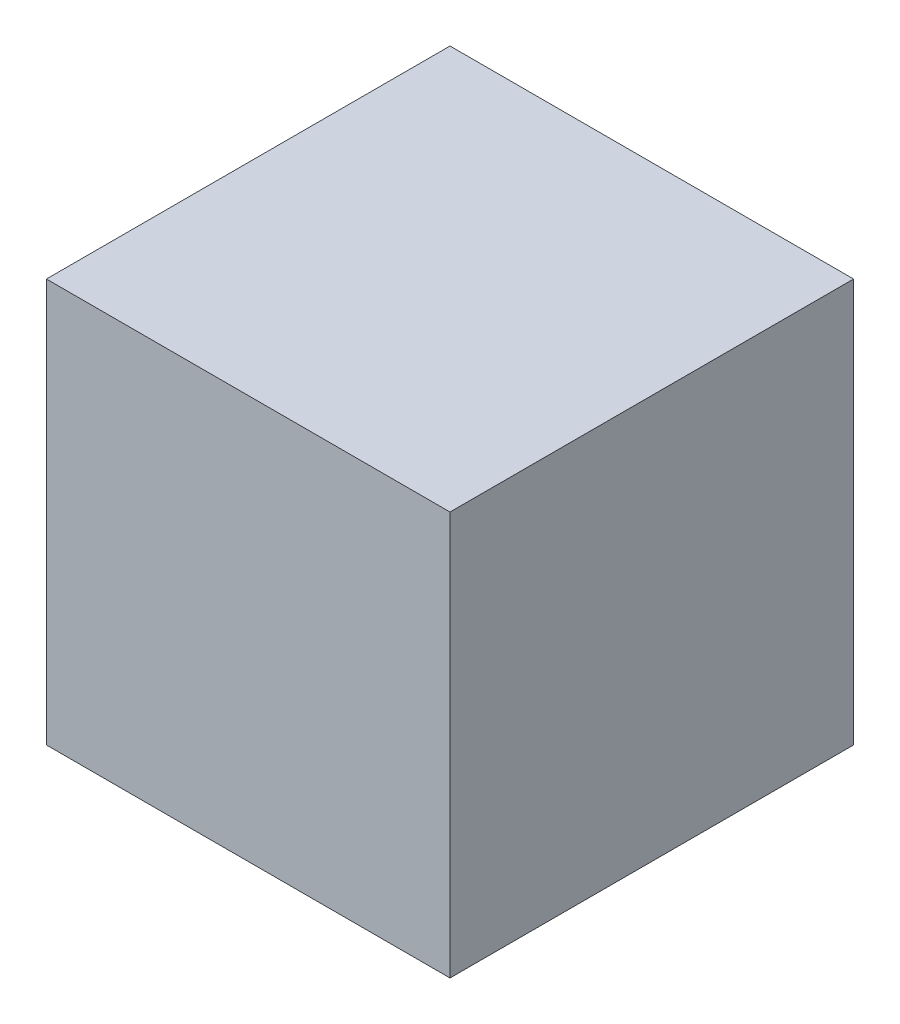
ISO-10303-21;
HEADER;
FILE_DESCRIPTION(('STEP AP214'),'2;1');
FILE_NAME('part.step','',(''),(''),'','','');
FILE_SCHEMA(('AUTOMOTIVE_DESIGN { 1 0 10303 214 1 1 1 1 }'));
ENDSEC;
DATA;
#1=APPLICATION_CONTEXT('core data for automotive mechanical design processes');
#2=APPLICATION_PROTOCOL_DEFINITION('international standard','automotive_design',2000,#1);
#3=PRODUCT_CONTEXT('',#1,'mechanical');
#4=PRODUCT('Part','Part','',(#3));
#5=PRODUCT_RELATED_PRODUCT_CATEGORY('part','',(#4));
#6=PRODUCT_DEFINITION_FORMATION('','',#4);
#7=PRODUCT_DEFINITION_CONTEXT('part definition',#1,'design');
#8=PRODUCT_DEFINITION('design','',#6,#7);
#9=PRODUCT_DEFINITION_SHAPE('','',#8);
#10=(LENGTH_UNIT() NAMED_UNIT(*) SI_UNIT(.MILLI.,.METRE.));
#11=(NAMED_UNIT(*) PLANE_ANGLE_UNIT() SI_UNIT($,.RADIAN.));
#12=(NAMED_UNIT(*) SI_UNIT($,.STERADIAN.) SOLID_ANGLE_UNIT());
#13=UNCERTAINTY_MEASURE_WITH_UNIT(LENGTH_MEASURE(1.E-05),#10,'distance_accuracy_value','');
#14=(GEOMETRIC_REPRESENTATION_CONTEXT(3) GLOBAL_UNCERTAINTY_ASSIGNED_CONTEXT((#13)) GLOBAL_UNIT_ASSIGNED_CONTEXT((#10,
#11,#12)) REPRESENTATION_CONTEXT('',''));
#15=CARTESIAN_POINT('',(0.,0.,0.));
#16=DIRECTION('',(0.,0.,1.));
#17=DIRECTION('',(1.,0.,0.));
#18=AXIS2_PLACEMENT_3D('',#15,#16,#17);
#19=CARTESIAN_POINT('',(50.,50.,50.));
#20=DIRECTION('',(-1.,0.,0.));
#21=DIRECTION('',(0.,-1.,0.));
#22=AXIS2_PLACEMENT_3D('',#19,#20,#21);
#23=PLANE('',#22);
#24=DIRECTION('',(0.,1.,0.));
#25=VECTOR('',#24,1.);
#26=CARTESIAN_POINT('',(50.,50.,-50.));
#27=LINE('',#26,#25);
#28=CARTESIAN_POINT('',(50.,-50.,-50.));
#29=VERTEX_POINT('',#28);
#30=CARTESIAN_POINT('',(50.,50.,-50.));
#31=VERTEX_POINT('',#30);
#32=EDGE_CURVE('E95',#29,#31,#27,.T.);
#33=ORIENTED_EDGE('',*,*,#32,.T.);
#34=DIRECTION('',(0.,0.,-1.));
#35=VECTOR('',#34,1.);
#36=CARTESIAN_POINT('',(50.,50.,50.));
#37=LINE('',#36,#35);
#38=CARTESIAN_POINT('',(50.,50.,50.));
#39=VERTEX_POINT('',#38);
#40=EDGE_CURVE('E11',#39,#31,#37,.T.);
#41=ORIENTED_EDGE('',*,*,#40,.F.);
#42=DIRECTION('',(0.,1.,0.));
#43=VECTOR('',#42,1.);
#44=CARTESIAN_POINT('',(50.,50.,50.));
#45=LINE('',#44,#43);
#46=CARTESIAN_POINT('',(50.,-50.,50.));
#47=VERTEX_POINT('',#46);
#48=EDGE_CURVE('E83',#47,#39,#45,.T.);
#49=ORIENTED_EDGE('',*,*,#48,.F.);
#50=DIRECTION('',(0.,0.,-1.));
#51=VECTOR('',#50,1.);
#52=CARTESIAN_POINT('',(50.,-50.,50.));
#53=LINE('',#52,#51);
#54=EDGE_CURVE('E91',#47,#29,#53,.T.);
#55=ORIENTED_EDGE('',*,*,#54,.T.);
#56=EDGE_LOOP('',(#33,#41,#49,#55));
#57=FACE_BOUND('',#56,.T.);
#58=ADVANCED_FACE('F32',(#57),#23,.F.);
#59=CARTESIAN_POINT('',(-50.,50.,50.));
#60=DIRECTION('',(0.,-1.,0.));
#61=DIRECTION('',(0.,0.,-1.));
#62=AXIS2_PLACEMENT_3D('',#59,#60,#61);
#63=PLANE('',#62);
#64=DIRECTION('',(-1.,0.,0.));
#65=VECTOR('',#64,1.);
#66=CARTESIAN_POINT('',(-50.,50.,-50.));
#67=LINE('',#66,#65);
#68=CARTESIAN_POINT('',(-50.,50.,-50.));
#69=VERTEX_POINT('',#68);
#70=EDGE_CURVE('E87',#31,#69,#67,.T.);
#71=ORIENTED_EDGE('',*,*,#70,.T.);
#72=DIRECTION('',(0.,0.,-1.));
#73=VECTOR('',#72,1.);
#74=CARTESIAN_POINT('',(-50.,50.,50.));
#75=LINE('',#74,#73);
#76=CARTESIAN_POINT('',(-50.,50.,50.));
#77=VERTEX_POINT('',#76);
#78=EDGE_CURVE('E40',#77,#69,#75,.T.);
#79=ORIENTED_EDGE('',*,*,#78,.F.);
#80=DIRECTION('',(-1.,0.,0.));
#81=VECTOR('',#80,1.);
#82=CARTESIAN_POINT('',(-50.,50.,50.));
#83=LINE('',#82,#81);
#84=EDGE_CURVE('E78',#39,#77,#83,.T.);
#85=ORIENTED_EDGE('',*,*,#84,.F.);
#86=ORIENTED_EDGE('',*,*,#40,.T.);
#87=EDGE_LOOP('',(#71,#79,#85,#86));
#88=FACE_BOUND('',#87,.T.);
#89=ADVANCED_FACE('F86',(#88),#63,.F.);
#90=CARTESIAN_POINT('',(-50.,50.,50.));
#91=DIRECTION('',(1.,0.,0.));
#92=DIRECTION('',(0.,1.,0.));
#93=AXIS2_PLACEMENT_3D('',#90,#91,#92);
#94=PLANE('',#93);
#95=DIRECTION('',(0.,-1.,0.));
#96=VECTOR('',#95,1.);
#97=CARTESIAN_POINT('',(-50.,50.,-50.));
#98=LINE('',#97,#96);
#99=CARTESIAN_POINT('',(-50.,-50.,-50.));
#100=VERTEX_POINT('',#99);
#101=EDGE_CURVE('E65',#69,#100,#98,.T.);
#102=ORIENTED_EDGE('',*,*,#101,.T.);
#103=DIRECTION('',(0.,0.,-1.));
#104=VECTOR('',#103,1.);
#105=CARTESIAN_POINT('',(-50.,-50.,50.));
#106=LINE('',#105,#104);
#107=CARTESIAN_POINT('',(-50.,-50.,50.));
#108=VERTEX_POINT('',#107);
#109=EDGE_CURVE('E88',#108,#100,#106,.T.);
#110=ORIENTED_EDGE('',*,*,#109,.F.);
#111=DIRECTION('',(0.,-1.,0.));
#112=VECTOR('',#111,1.);
#113=CARTESIAN_POINT('',(-50.,50.,50.));
#114=LINE('',#113,#112);
#115=EDGE_CURVE('E81',#77,#108,#114,.T.);
#116=ORIENTED_EDGE('',*,*,#115,.F.);
#117=ORIENTED_EDGE('',*,*,#78,.T.);
#118=EDGE_LOOP('',(#102,#110,#116,#117));
#119=FACE_BOUND('',#118,.T.);
#120=ADVANCED_FACE('F89',(#119),#94,.F.);
#121=CARTESIAN_POINT('',(-50.,-50.,50.));
#122=DIRECTION('',(0.,1.,0.));
#123=DIRECTION('',(0.,0.,1.));
#124=AXIS2_PLACEMENT_3D('',#121,#122,#123);
#125=PLANE('',#124);
#126=DIRECTION('',(1.,0.,0.));
#127=VECTOR('',#126,1.);
#128=CARTESIAN_POINT('',(-50.,-50.,-50.));
#129=LINE('',#128,#127);
#130=EDGE_CURVE('E71',#100,#29,#129,.T.);
#131=ORIENTED_EDGE('',*,*,#130,.T.);
#132=ORIENTED_EDGE('',*,*,#54,.F.);
#133=DIRECTION('',(1.,0.,0.));
#134=VECTOR('',#133,1.);
#135=CARTESIAN_POINT('',(-50.,-50.,50.));
#136=LINE('',#135,#134);
#137=EDGE_CURVE('E48',#108,#47,#136,.T.);
#138=ORIENTED_EDGE('',*,*,#137,.F.);
#139=ORIENTED_EDGE('',*,*,#109,.T.);
#140=EDGE_LOOP('',(#131,#132,#138,#139));
#141=FACE_BOUND('',#140,.T.);
#142=ADVANCED_FACE('F102',(#141),#125,.F.);
#143=CARTESIAN_POINT('',(0.,0.,50.));
#144=DIRECTION('',(0.,0.,1.));
#145=DIRECTION('',(1.,0.,0.));
#146=AXIS2_PLACEMENT_3D('',#143,#144,#145);
#147=PLANE('',#146);
#148=ORIENTED_EDGE('',*,*,#48,.T.);
#149=ORIENTED_EDGE('',*,*,#84,.T.);
#150=ORIENTED_EDGE('',*,*,#115,.T.);
#151=ORIENTED_EDGE('',*,*,#137,.T.);
#152=EDGE_LOOP('',(#148,#149,#150,#151));
#153=FACE_BOUND('',#152,.T.);
#154=ADVANCED_FACE('F79',(#153),#147,.T.);
#155=CARTESIAN_POINT('',(0.,0.,-50.));
#156=DIRECTION('',(0.,0.,1.));
#157=DIRECTION('',(1.,0.,0.));
#158=AXIS2_PLACEMENT_3D('',#155,#156,#157);
#159=PLANE('',#158);
#160=ORIENTED_EDGE('',*,*,#32,.F.);
#161=ORIENTED_EDGE('',*,*,#130,.F.);
#162=ORIENTED_EDGE('',*,*,#101,.F.);
#163=ORIENTED_EDGE('',*,*,#70,.F.);
#164=EDGE_LOOP('',(#160,#161,#162,#163));
#165=FACE_BOUND('',#164,.T.);
#166=ADVANCED_FACE('F105',(#165),#159,.F.);
#167=CLOSED_SHELL('',(#58,#89,#120,#142,#154,#166));
#168=MANIFOLD_SOLID_BREP('B2',#167);
#169=ADVANCED_BREP_SHAPE_REPRESENTATION('',(#18,#168),#14);
#170=SHAPE_DEFINITION_REPRESENTATION(#9,#169);
ENDSEC;
END-ISO-10303-21;
